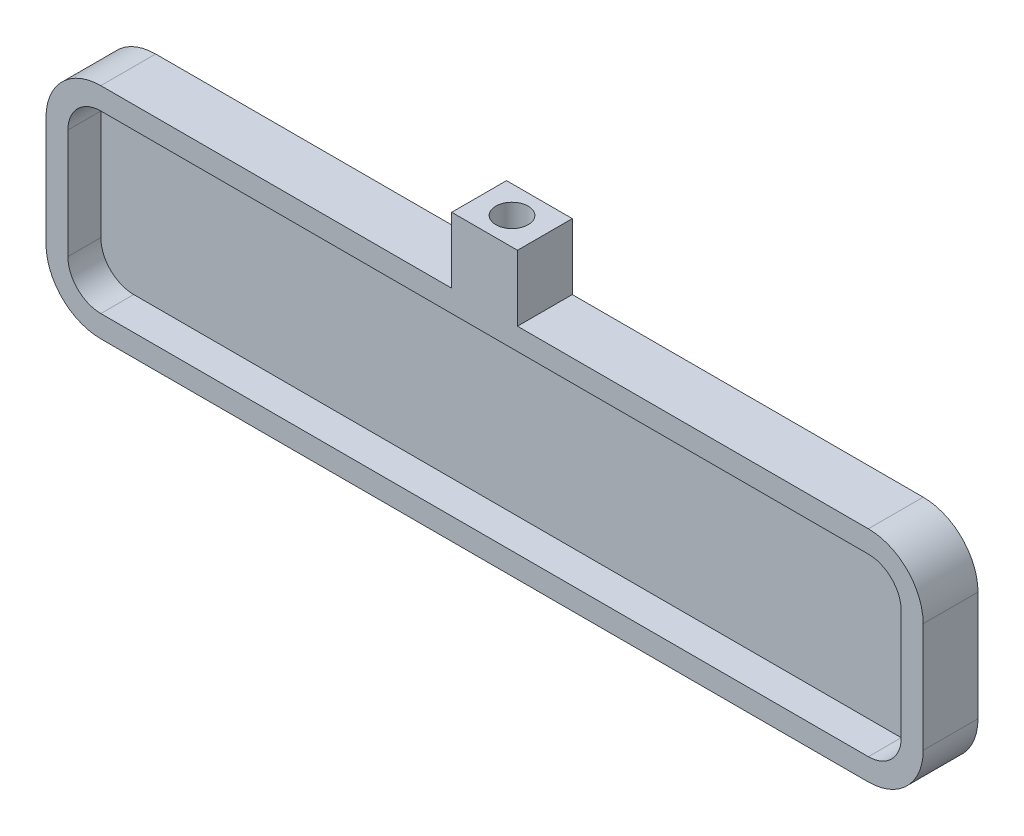
ISO-10303-21;
HEADER;
FILE_DESCRIPTION(('STEP AP214'),'2;1');
FILE_NAME('part.step','',(''),(''),'','','');
FILE_SCHEMA(('AUTOMOTIVE_DESIGN { 1 0 10303 214 1 1 1 1 }'));
ENDSEC;
DATA;
#1=APPLICATION_CONTEXT('core data for automotive mechanical design processes');
#2=APPLICATION_PROTOCOL_DEFINITION('international standard','automotive_design',2000,#1);
#3=PRODUCT_CONTEXT('',#1,'mechanical');
#4=PRODUCT('Part','Part','',(#3));
#5=PRODUCT_RELATED_PRODUCT_CATEGORY('part','',(#4));
#6=PRODUCT_DEFINITION_FORMATION('','',#4);
#7=PRODUCT_DEFINITION_CONTEXT('part definition',#1,'design');
#8=PRODUCT_DEFINITION('design','',#6,#7);
#9=PRODUCT_DEFINITION_SHAPE('','',#8);
#10=(LENGTH_UNIT() NAMED_UNIT(*) SI_UNIT(.MILLI.,.METRE.));
#11=(NAMED_UNIT(*) PLANE_ANGLE_UNIT() SI_UNIT($,.RADIAN.));
#12=(NAMED_UNIT(*) SI_UNIT($,.STERADIAN.) SOLID_ANGLE_UNIT());
#13=UNCERTAINTY_MEASURE_WITH_UNIT(LENGTH_MEASURE(1.E-05),#10,'distance_accuracy_value','');
#14=(GEOMETRIC_REPRESENTATION_CONTEXT(3) GLOBAL_UNCERTAINTY_ASSIGNED_CONTEXT((#13)) GLOBAL_UNIT_ASSIGNED_CONTEXT((#10,
#11,#12)) REPRESENTATION_CONTEXT('',''));
#15=CARTESIAN_POINT('',(0.,0.,0.));
#16=DIRECTION('',(0.,0.,1.));
#17=DIRECTION('',(1.,0.,0.));
#18=AXIS2_PLACEMENT_3D('',#15,#16,#17);
#19=CARTESIAN_POINT('',(-40.,10.,5.));
#20=DIRECTION('',(0.,-1.,0.));
#21=DIRECTION('',(0.,0.,-1.));
#22=AXIS2_PLACEMENT_3D('',#19,#20,#21);
#23=PLANE('',#22);
#24=DIRECTION('',(0.,0.,1.));
#25=VECTOR('',#24,1.);
#26=CARTESIAN_POINT('',(-3.,10.,0.));
#27=LINE('',#26,#25);
#28=CARTESIAN_POINT('',(-3.,10.,0.));
#29=VERTEX_POINT('',#28);
#30=CARTESIAN_POINT('',(-3.,10.,5.));
#31=VERTEX_POINT('',#30);
#32=EDGE_CURVE('E202',#29,#31,#27,.T.);
#33=ORIENTED_EDGE('',*,*,#32,.F.);
#34=DIRECTION('',(-1.,0.,0.));
#35=VECTOR('',#34,1.);
#36=CARTESIAN_POINT('',(-40.,10.,0.));
#37=LINE('',#36,#35);
#38=CARTESIAN_POINT('',(-35.,10.,0.));
#39=VERTEX_POINT('',#38);
#40=EDGE_CURVE('E187',#29,#39,#37,.T.);
#41=ORIENTED_EDGE('',*,*,#40,.T.);
#42=DIRECTION('',(0.,0.,-1.));
#43=VECTOR('',#42,1.);
#44=CARTESIAN_POINT('',(-35.,10.,5.));
#45=LINE('',#44,#43);
#46=CARTESIAN_POINT('',(-35.,10.,5.));
#47=VERTEX_POINT('',#46);
#48=EDGE_CURVE('E308',#39,#47,#45,.F.);
#49=ORIENTED_EDGE('',*,*,#48,.T.);
#50=DIRECTION('',(-1.,0.,0.));
#51=VECTOR('',#50,1.);
#52=CARTESIAN_POINT('',(-40.,10.,5.));
#53=LINE('',#52,#51);
#54=EDGE_CURVE('E47',#31,#47,#53,.T.);
#55=ORIENTED_EDGE('',*,*,#54,.F.);
#56=EDGE_LOOP('',(#33,#41,#49,#55));
#57=FACE_BOUND('',#56,.T.);
#58=ADVANCED_FACE('F32',(#57),#23,.F.);
#59=DIRECTION('',(0.,0.,-1.));
#60=VECTOR('',#59,1.);
#61=CARTESIAN_POINT('',(3.,10.,5.));
#62=LINE('',#61,#60);
#63=CARTESIAN_POINT('',(3.,10.,5.));
#64=VERTEX_POINT('',#63);
#65=CARTESIAN_POINT('',(3.,10.,0.));
#66=VERTEX_POINT('',#65);
#67=EDGE_CURVE('E55',#64,#66,#62,.T.);
#68=ORIENTED_EDGE('',*,*,#67,.F.);
#69=CARTESIAN_POINT('',(35.,10.,5.));
#70=VERTEX_POINT('',#69);
#71=EDGE_CURVE('E275',#70,#64,#53,.T.);
#72=ORIENTED_EDGE('',*,*,#71,.F.);
#73=DIRECTION('',(0.,0.,-1.));
#74=VECTOR('',#73,1.);
#75=CARTESIAN_POINT('',(35.,10.,5.));
#76=LINE('',#75,#74);
#77=CARTESIAN_POINT('',(35.,10.,0.));
#78=VERTEX_POINT('',#77);
#79=EDGE_CURVE('E305',#70,#78,#76,.T.);
#80=ORIENTED_EDGE('',*,*,#79,.T.);
#81=EDGE_CURVE('E286',#78,#66,#37,.T.);
#82=ORIENTED_EDGE('',*,*,#81,.T.);
#83=EDGE_LOOP('',(#68,#72,#80,#82));
#84=FACE_BOUND('',#83,.T.);
#85=ADVANCED_FACE('F335',(#84),#23,.F.);
#86=CARTESIAN_POINT('',(40.,-10.,5.));
#87=DIRECTION('',(-1.,0.,0.));
#88=DIRECTION('',(0.,0.,1.));
#89=AXIS2_PLACEMENT_3D('',#86,#87,#88);
#90=PLANE('',#89);
#91=DIRECTION('',(0.,1.,0.));
#92=VECTOR('',#91,1.);
#93=CARTESIAN_POINT('',(40.,-10.,5.));
#94=LINE('',#93,#92);
#95=CARTESIAN_POINT('',(40.,-5.,5.));
#96=VERTEX_POINT('',#95);
#97=CARTESIAN_POINT('',(40.,5.,5.));
#98=VERTEX_POINT('',#97);
#99=EDGE_CURVE('E271',#96,#98,#94,.T.);
#100=ORIENTED_EDGE('',*,*,#99,.F.);
#101=DIRECTION('',(0.,0.,-1.));
#102=VECTOR('',#101,1.);
#103=CARTESIAN_POINT('',(40.,-5.,5.));
#104=LINE('',#103,#102);
#105=CARTESIAN_POINT('',(40.,-5.,0.));
#106=VERTEX_POINT('',#105);
#107=EDGE_CURVE('E11',#96,#106,#104,.T.);
#108=ORIENTED_EDGE('',*,*,#107,.T.);
#109=DIRECTION('',(0.,1.,0.));
#110=VECTOR('',#109,1.);
#111=CARTESIAN_POINT('',(40.,-10.,0.));
#112=LINE('',#111,#110);
#113=CARTESIAN_POINT('',(40.,5.,0.));
#114=VERTEX_POINT('',#113);
#115=EDGE_CURVE('E214',#106,#114,#112,.T.);
#116=ORIENTED_EDGE('',*,*,#115,.T.);
#117=DIRECTION('',(0.,0.,-1.));
#118=VECTOR('',#117,1.);
#119=CARTESIAN_POINT('',(40.,5.,5.));
#120=LINE('',#119,#118);
#121=EDGE_CURVE('E40',#114,#98,#120,.F.);
#122=ORIENTED_EDGE('',*,*,#121,.T.);
#123=EDGE_LOOP('',(#100,#108,#116,#122));
#124=FACE_BOUND('',#123,.T.);
#125=ADVANCED_FACE('F325',(#124),#90,.F.);
#126=CARTESIAN_POINT('',(-40.,-10.,5.));
#127=DIRECTION('',(1.,0.,0.));
#128=DIRECTION('',(0.,0.,-1.));
#129=AXIS2_PLACEMENT_3D('',#126,#127,#128);
#130=PLANE('',#129);
#131=DIRECTION('',(0.,-1.,0.));
#132=VECTOR('',#131,1.);
#133=CARTESIAN_POINT('',(-40.,-10.,5.));
#134=LINE('',#133,#132);
#135=CARTESIAN_POINT('',(-40.,5.,5.));
#136=VERTEX_POINT('',#135);
#137=CARTESIAN_POINT('',(-40.,-5.,5.));
#138=VERTEX_POINT('',#137);
#139=EDGE_CURVE('E277',#136,#138,#134,.T.);
#140=ORIENTED_EDGE('',*,*,#139,.F.);
#141=DIRECTION('',(0.,0.,-1.));
#142=VECTOR('',#141,1.);
#143=CARTESIAN_POINT('',(-40.,5.,5.));
#144=LINE('',#143,#142);
#145=CARTESIAN_POINT('',(-40.,5.,0.));
#146=VERTEX_POINT('',#145);
#147=EDGE_CURVE('E294',#136,#146,#144,.T.);
#148=ORIENTED_EDGE('',*,*,#147,.T.);
#149=DIRECTION('',(0.,-1.,0.));
#150=VECTOR('',#149,1.);
#151=CARTESIAN_POINT('',(-40.,-10.,0.));
#152=LINE('',#151,#150);
#153=CARTESIAN_POINT('',(-40.,-5.,0.));
#154=VERTEX_POINT('',#153);
#155=EDGE_CURVE('E288',#146,#154,#152,.T.);
#156=ORIENTED_EDGE('',*,*,#155,.T.);
#157=DIRECTION('',(0.,0.,-1.));
#158=VECTOR('',#157,1.);
#159=CARTESIAN_POINT('',(-40.,-5.,5.));
#160=LINE('',#159,#158);
#161=EDGE_CURVE('E283',#154,#138,#160,.F.);
#162=ORIENTED_EDGE('',*,*,#161,.T.);
#163=EDGE_LOOP('',(#140,#148,#156,#162));
#164=FACE_BOUND('',#163,.T.);
#165=ADVANCED_FACE('F346',(#164),#130,.F.);
#166=CARTESIAN_POINT('',(-40.,-10.,5.));
#167=DIRECTION('',(0.,1.,0.));
#168=DIRECTION('',(0.,0.,1.));
#169=AXIS2_PLACEMENT_3D('',#166,#167,#168);
#170=PLANE('',#169);
#171=DIRECTION('',(1.,0.,0.));
#172=VECTOR('',#171,1.);
#173=CARTESIAN_POINT('',(-40.,-10.,5.));
#174=LINE('',#173,#172);
#175=CARTESIAN_POINT('',(-35.,-10.,5.));
#176=VERTEX_POINT('',#175);
#177=CARTESIAN_POINT('',(35.,-10.,5.));
#178=VERTEX_POINT('',#177);
#179=EDGE_CURVE('E280',#176,#178,#174,.T.);
#180=ORIENTED_EDGE('',*,*,#179,.F.);
#181=DIRECTION('',(0.,0.,-1.));
#182=VECTOR('',#181,1.);
#183=CARTESIAN_POINT('',(-35.,-10.,5.));
#184=LINE('',#183,#182);
#185=CARTESIAN_POINT('',(-35.,-10.,0.));
#186=VERTEX_POINT('',#185);
#187=EDGE_CURVE('E320',#176,#186,#184,.T.);
#188=ORIENTED_EDGE('',*,*,#187,.T.);
#189=DIRECTION('',(1.,0.,0.));
#190=VECTOR('',#189,1.);
#191=CARTESIAN_POINT('',(-40.,-10.,0.));
#192=LINE('',#191,#190);
#193=CARTESIAN_POINT('',(35.,-10.,0.));
#194=VERTEX_POINT('',#193);
#195=EDGE_CURVE('E274',#186,#194,#192,.T.);
#196=ORIENTED_EDGE('',*,*,#195,.T.);
#197=DIRECTION('',(0.,0.,-1.));
#198=VECTOR('',#197,1.);
#199=CARTESIAN_POINT('',(35.,-10.,5.));
#200=LINE('',#199,#198);
#201=EDGE_CURVE('E318',#194,#178,#200,.F.);
#202=ORIENTED_EDGE('',*,*,#201,.T.);
#203=EDGE_LOOP('',(#180,#188,#196,#202));
#204=FACE_BOUND('',#203,.T.);
#205=ADVANCED_FACE('F355',(#204),#170,.F.);
#206=CARTESIAN_POINT('',(0.,0.,5.));
#207=DIRECTION('',(0.,0.,-1.));
#208=DIRECTION('',(-1.,0.,0.));
#209=AXIS2_PLACEMENT_3D('',#206,#207,#208);
#210=PLANE('',#209);
#211=DIRECTION('',(-1.,0.,0.));
#212=VECTOR('',#211,1.);
#213=CARTESIAN_POINT('',(0.,8.,5.));
#214=LINE('',#213,#212);
#215=CARTESIAN_POINT('',(35.,8.,5.));
#216=VERTEX_POINT('',#215);
#217=CARTESIAN_POINT('',(-35.,8.,5.));
#218=VERTEX_POINT('',#217);
#219=EDGE_CURVE('E257',#216,#218,#214,.T.);
#220=ORIENTED_EDGE('',*,*,#219,.F.);
#221=CARTESIAN_POINT('',(35.,5.,5.));
#222=DIRECTION('',(0.,0.,-1.));
#223=DIRECTION('',(-1.,0.,0.));
#224=AXIS2_PLACEMENT_3D('',#221,#222,#223);
#225=CIRCLE('',#224,3.);
#226=CARTESIAN_POINT('',(38.,5.,5.));
#227=VERTEX_POINT('',#226);
#228=EDGE_CURVE('E243',#227,#216,#225,.F.);
#229=ORIENTED_EDGE('',*,*,#228,.F.);
#230=DIRECTION('',(0.,1.,0.));
#231=VECTOR('',#230,1.);
#232=CARTESIAN_POINT('',(38.,0.,5.));
#233=LINE('',#232,#231);
#234=CARTESIAN_POINT('',(38.,-5.,5.));
#235=VERTEX_POINT('',#234);
#236=EDGE_CURVE('E239',#235,#227,#233,.T.);
#237=ORIENTED_EDGE('',*,*,#236,.F.);
#238=CARTESIAN_POINT('',(35.,-5.,5.));
#239=DIRECTION('',(0.,0.,-1.));
#240=DIRECTION('',(-1.,0.,0.));
#241=AXIS2_PLACEMENT_3D('',#238,#239,#240);
#242=CIRCLE('',#241,3.);
#243=CARTESIAN_POINT('',(35.,-8.,5.));
#244=VERTEX_POINT('',#243);
#245=EDGE_CURVE('E259',#244,#235,#242,.F.);
#246=ORIENTED_EDGE('',*,*,#245,.F.);
#247=DIRECTION('',(1.,0.,0.));
#248=VECTOR('',#247,1.);
#249=CARTESIAN_POINT('',(0.,-8.,5.));
#250=LINE('',#249,#248);
#251=CARTESIAN_POINT('',(-35.,-8.,5.));
#252=VERTEX_POINT('',#251);
#253=EDGE_CURVE('E250',#252,#244,#250,.T.);
#254=ORIENTED_EDGE('',*,*,#253,.F.);
#255=CARTESIAN_POINT('',(-35.,-5.,5.));
#256=DIRECTION('',(0.,0.,-1.));
#257=DIRECTION('',(-1.,0.,0.));
#258=AXIS2_PLACEMENT_3D('',#255,#256,#257);
#259=CIRCLE('',#258,3.);
#260=CARTESIAN_POINT('',(-38.,-5.,5.));
#261=VERTEX_POINT('',#260);
#262=EDGE_CURVE('E264',#261,#252,#259,.F.);
#263=ORIENTED_EDGE('',*,*,#262,.F.);
#264=DIRECTION('',(0.,-1.,0.));
#265=VECTOR('',#264,1.);
#266=CARTESIAN_POINT('',(-38.,0.,5.));
#267=LINE('',#266,#265);
#268=CARTESIAN_POINT('',(-38.,5.,5.));
#269=VERTEX_POINT('',#268);
#270=EDGE_CURVE('E262',#269,#261,#267,.T.);
#271=ORIENTED_EDGE('',*,*,#270,.F.);
#272=CARTESIAN_POINT('',(-35.,5.,5.));
#273=DIRECTION('',(0.,0.,-1.));
#274=DIRECTION('',(-1.,0.,0.));
#275=AXIS2_PLACEMENT_3D('',#272,#273,#274);
#276=CIRCLE('',#275,3.);
#277=EDGE_CURVE('E255',#218,#269,#276,.F.);
#278=ORIENTED_EDGE('',*,*,#277,.F.);
#279=EDGE_LOOP('',(#220,#229,#237,#246,#254,#263,#271,#278));
#280=FACE_BOUND('',#279,.T.);
#281=ORIENTED_EDGE('',*,*,#71,.T.);
#282=DIRECTION('',(0.,-1.,0.));
#283=VECTOR('',#282,1.);
#284=CARTESIAN_POINT('',(3.,16.,5.));
#285=LINE('',#284,#283);
#286=CARTESIAN_POINT('',(3.,16.,5.));
#287=VERTEX_POINT('',#286);
#288=EDGE_CURVE('E207',#287,#64,#285,.T.);
#289=ORIENTED_EDGE('',*,*,#288,.F.);
#290=DIRECTION('',(1.,0.,0.));
#291=VECTOR('',#290,1.);
#292=CARTESIAN_POINT('',(-3.,16.,5.));
#293=LINE('',#292,#291);
#294=CARTESIAN_POINT('',(-3.,16.,5.));
#295=VERTEX_POINT('',#294);
#296=EDGE_CURVE('E195',#295,#287,#293,.T.);
#297=ORIENTED_EDGE('',*,*,#296,.F.);
#298=DIRECTION('',(0.,-1.,0.));
#299=VECTOR('',#298,1.);
#300=CARTESIAN_POINT('',(-3.,16.,5.));
#301=LINE('',#300,#299);
#302=EDGE_CURVE('E190',#295,#31,#301,.T.);
#303=ORIENTED_EDGE('',*,*,#302,.T.);
#304=ORIENTED_EDGE('',*,*,#54,.T.);
#305=CARTESIAN_POINT('',(-35.,5.,5.));
#306=DIRECTION('',(0.,0.,-1.));
#307=DIRECTION('',(-1.,0.,0.));
#308=AXIS2_PLACEMENT_3D('',#305,#306,#307);
#309=CIRCLE('',#308,5.);
#310=EDGE_CURVE('E316',#47,#136,#309,.F.);
#311=ORIENTED_EDGE('',*,*,#310,.T.);
#312=ORIENTED_EDGE('',*,*,#139,.T.);
#313=CARTESIAN_POINT('',(-35.,-5.,5.));
#314=DIRECTION('',(0.,0.,-1.));
#315=DIRECTION('',(-1.,0.,0.));
#316=AXIS2_PLACEMENT_3D('',#313,#314,#315);
#317=CIRCLE('',#316,5.);
#318=EDGE_CURVE('E314',#138,#176,#317,.F.);
#319=ORIENTED_EDGE('',*,*,#318,.T.);
#320=ORIENTED_EDGE('',*,*,#179,.T.);
#321=CARTESIAN_POINT('',(35.,-5.,5.));
#322=DIRECTION('',(0.,0.,-1.));
#323=DIRECTION('',(-1.,0.,0.));
#324=AXIS2_PLACEMENT_3D('',#321,#322,#323);
#325=CIRCLE('',#324,5.);
#326=EDGE_CURVE('E312',#178,#96,#325,.F.);
#327=ORIENTED_EDGE('',*,*,#326,.T.);
#328=ORIENTED_EDGE('',*,*,#99,.T.);
#329=CARTESIAN_POINT('',(35.,5.,5.));
#330=DIRECTION('',(0.,0.,-1.));
#331=DIRECTION('',(-1.,0.,0.));
#332=AXIS2_PLACEMENT_3D('',#329,#330,#331);
#333=CIRCLE('',#332,5.);
#334=EDGE_CURVE('E310',#98,#70,#333,.F.);
#335=ORIENTED_EDGE('',*,*,#334,.T.);
#336=EDGE_LOOP('',(#281,#289,#297,#303,#304,#311,#312,#319,#320,#327,#328,#335));
#337=FACE_BOUND('',#336,.T.);
#338=ADVANCED_FACE('F331',(#280,#337),#210,.F.);
#339=CARTESIAN_POINT('',(0.,0.,0.));
#340=DIRECTION('',(0.,0.,-1.));
#341=DIRECTION('',(-1.,0.,0.));
#342=AXIS2_PLACEMENT_3D('',#339,#340,#341);
#343=PLANE('',#342);
#344=ORIENTED_EDGE('',*,*,#155,.F.);
#345=CARTESIAN_POINT('',(-35.,5.,0.));
#346=DIRECTION('',(0.,0.,-1.));
#347=DIRECTION('',(-1.,0.,0.));
#348=AXIS2_PLACEMENT_3D('',#345,#346,#347);
#349=CIRCLE('',#348,5.);
#350=EDGE_CURVE('E303',#146,#39,#349,.T.);
#351=ORIENTED_EDGE('',*,*,#350,.T.);
#352=ORIENTED_EDGE('',*,*,#40,.F.);
#353=DIRECTION('',(0.,-1.,0.));
#354=VECTOR('',#353,1.);
#355=CARTESIAN_POINT('',(-3.,16.,0.));
#356=LINE('',#355,#354);
#357=CARTESIAN_POINT('',(-3.,16.,0.));
#358=VERTEX_POINT('',#357);
#359=EDGE_CURVE('E183',#358,#29,#356,.T.);
#360=ORIENTED_EDGE('',*,*,#359,.F.);
#361=DIRECTION('',(-1.,0.,0.));
#362=VECTOR('',#361,1.);
#363=CARTESIAN_POINT('',(3.,16.,0.));
#364=LINE('',#363,#362);
#365=CARTESIAN_POINT('',(3.,16.,0.));
#366=VERTEX_POINT('',#365);
#367=EDGE_CURVE('E170',#366,#358,#364,.T.);
#368=ORIENTED_EDGE('',*,*,#367,.F.);
#369=DIRECTION('',(0.,-1.,0.));
#370=VECTOR('',#369,1.);
#371=CARTESIAN_POINT('',(3.,16.,0.));
#372=LINE('',#371,#370);
#373=EDGE_CURVE('E201',#366,#66,#372,.T.);
#374=ORIENTED_EDGE('',*,*,#373,.T.);
#375=ORIENTED_EDGE('',*,*,#81,.F.);
#376=CARTESIAN_POINT('',(35.,5.,0.));
#377=DIRECTION('',(0.,0.,-1.));
#378=DIRECTION('',(-1.,0.,0.));
#379=AXIS2_PLACEMENT_3D('',#376,#377,#378);
#380=CIRCLE('',#379,5.);
#381=EDGE_CURVE('E297',#78,#114,#380,.T.);
#382=ORIENTED_EDGE('',*,*,#381,.T.);
#383=ORIENTED_EDGE('',*,*,#115,.F.);
#384=CARTESIAN_POINT('',(35.,-5.,0.));
#385=DIRECTION('',(0.,0.,-1.));
#386=DIRECTION('',(-1.,0.,0.));
#387=AXIS2_PLACEMENT_3D('',#384,#385,#386);
#388=CIRCLE('',#387,5.);
#389=EDGE_CURVE('E299',#106,#194,#388,.T.);
#390=ORIENTED_EDGE('',*,*,#389,.T.);
#391=ORIENTED_EDGE('',*,*,#195,.F.);
#392=CARTESIAN_POINT('',(-35.,-5.,0.));
#393=DIRECTION('',(0.,0.,-1.));
#394=DIRECTION('',(-1.,0.,0.));
#395=AXIS2_PLACEMENT_3D('',#392,#393,#394);
#396=CIRCLE('',#395,5.);
#397=EDGE_CURVE('E301',#186,#154,#396,.T.);
#398=ORIENTED_EDGE('',*,*,#397,.T.);
#399=EDGE_LOOP('',(#344,#351,#352,#360,#368,#374,#375,#382,#383,#390,#391,#398));
#400=FACE_BOUND('',#399,.T.);
#401=ADVANCED_FACE('F185',(#400),#343,.T.);
#402=CARTESIAN_POINT('',(-35.,5.,5.));
#403=DIRECTION('',(0.,0.,-1.));
#404=DIRECTION('',(-1.,0.,0.));
#405=AXIS2_PLACEMENT_3D('',#402,#403,#404);
#406=CYLINDRICAL_SURFACE('',#405,5.);
#407=ORIENTED_EDGE('',*,*,#310,.F.);
#408=ORIENTED_EDGE('',*,*,#48,.F.);
#409=ORIENTED_EDGE('',*,*,#350,.F.);
#410=ORIENTED_EDGE('',*,*,#147,.F.);
#411=EDGE_LOOP('',(#407,#408,#409,#410));
#412=FACE_BOUND('',#411,.T.);
#413=ADVANCED_FACE('F344',(#412),#406,.T.);
#414=CARTESIAN_POINT('',(-35.,-5.,5.));
#415=DIRECTION('',(0.,0.,-1.));
#416=DIRECTION('',(-1.,0.,0.));
#417=AXIS2_PLACEMENT_3D('',#414,#415,#416);
#418=CYLINDRICAL_SURFACE('',#417,5.);
#419=ORIENTED_EDGE('',*,*,#318,.F.);
#420=ORIENTED_EDGE('',*,*,#161,.F.);
#421=ORIENTED_EDGE('',*,*,#397,.F.);
#422=ORIENTED_EDGE('',*,*,#187,.F.);
#423=EDGE_LOOP('',(#419,#420,#421,#422));
#424=FACE_BOUND('',#423,.T.);
#425=ADVANCED_FACE('F352',(#424),#418,.T.);
#426=CARTESIAN_POINT('',(35.,-5.,5.));
#427=DIRECTION('',(0.,0.,-1.));
#428=DIRECTION('',(-1.,0.,0.));
#429=AXIS2_PLACEMENT_3D('',#426,#427,#428);
#430=CYLINDRICAL_SURFACE('',#429,5.);
#431=ORIENTED_EDGE('',*,*,#326,.F.);
#432=ORIENTED_EDGE('',*,*,#201,.F.);
#433=ORIENTED_EDGE('',*,*,#389,.F.);
#434=ORIENTED_EDGE('',*,*,#107,.F.);
#435=EDGE_LOOP('',(#431,#432,#433,#434));
#436=FACE_BOUND('',#435,.T.);
#437=ADVANCED_FACE('F358',(#436),#430,.T.);
#438=CARTESIAN_POINT('',(35.,5.,5.));
#439=DIRECTION('',(0.,0.,-1.));
#440=DIRECTION('',(-1.,0.,0.));
#441=AXIS2_PLACEMENT_3D('',#438,#439,#440);
#442=CYLINDRICAL_SURFACE('',#441,5.);
#443=ORIENTED_EDGE('',*,*,#334,.F.);
#444=ORIENTED_EDGE('',*,*,#121,.F.);
#445=ORIENTED_EDGE('',*,*,#381,.F.);
#446=ORIENTED_EDGE('',*,*,#79,.F.);
#447=EDGE_LOOP('',(#443,#444,#445,#446));
#448=FACE_BOUND('',#447,.T.);
#449=ADVANCED_FACE('F34',(#448),#442,.T.);
#450=CARTESIAN_POINT('',(38.,-10.,5.));
#451=DIRECTION('',(-1.,0.,0.));
#452=DIRECTION('',(0.,0.,1.));
#453=AXIS2_PLACEMENT_3D('',#450,#451,#452);
#454=PLANE('',#453);
#455=ORIENTED_EDGE('',*,*,#236,.T.);
#456=DIRECTION('',(0.,0.,1.));
#457=VECTOR('',#456,1.);
#458=CARTESIAN_POINT('',(38.,5.,5.));
#459=LINE('',#458,#457);
#460=CARTESIAN_POINT('',(38.,5.,2.));
#461=VERTEX_POINT('',#460);
#462=EDGE_CURVE('E215',#461,#227,#459,.T.);
#463=ORIENTED_EDGE('',*,*,#462,.F.);
#464=DIRECTION('',(0.,1.,0.));
#465=VECTOR('',#464,1.);
#466=CARTESIAN_POINT('',(38.,0.,2.));
#467=LINE('',#466,#465);
#468=CARTESIAN_POINT('',(38.,-5.,2.));
#469=VERTEX_POINT('',#468);
#470=EDGE_CURVE('E189',#469,#461,#467,.T.);
#471=ORIENTED_EDGE('',*,*,#470,.F.);
#472=DIRECTION('',(0.,0.,1.));
#473=VECTOR('',#472,1.);
#474=CARTESIAN_POINT('',(38.,-5.,5.));
#475=LINE('',#474,#473);
#476=EDGE_CURVE('E211',#235,#469,#475,.F.);
#477=ORIENTED_EDGE('',*,*,#476,.F.);
#478=EDGE_LOOP('',(#455,#463,#471,#477));
#479=FACE_BOUND('',#478,.T.);
#480=ADVANCED_FACE('F364',(#479),#454,.T.);
#481=CARTESIAN_POINT('',(-40.,8.,5.));
#482=DIRECTION('',(0.,-1.,0.));
#483=DIRECTION('',(0.,0.,-1.));
#484=AXIS2_PLACEMENT_3D('',#481,#482,#483);
#485=PLANE('',#484);
#486=DIRECTION('',(-1.,0.,0.));
#487=VECTOR('',#486,1.);
#488=CARTESIAN_POINT('',(0.,8.,2.));
#489=LINE('',#488,#487);
#490=CARTESIAN_POINT('',(35.,8.,2.));
#491=VERTEX_POINT('',#490);
#492=CARTESIAN_POINT('',(-35.,8.,2.));
#493=VERTEX_POINT('',#492);
#494=EDGE_CURVE('E218',#491,#493,#489,.T.);
#495=ORIENTED_EDGE('',*,*,#494,.F.);
#496=DIRECTION('',(0.,0.,-1.));
#497=VECTOR('',#496,1.);
#498=CARTESIAN_POINT('',(35.,8.,5.));
#499=LINE('',#498,#497);
#500=EDGE_CURVE('E228',#216,#491,#499,.T.);
#501=ORIENTED_EDGE('',*,*,#500,.F.);
#502=ORIENTED_EDGE('',*,*,#219,.T.);
#503=DIRECTION('',(0.,0.,-1.));
#504=VECTOR('',#503,1.);
#505=CARTESIAN_POINT('',(-35.,8.,5.));
#506=LINE('',#505,#504);
#507=EDGE_CURVE('E241',#493,#218,#506,.F.);
#508=ORIENTED_EDGE('',*,*,#507,.F.);
#509=EDGE_LOOP('',(#495,#501,#502,#508));
#510=FACE_BOUND('',#509,.T.);
#511=ADVANCED_FACE('F472',(#510),#485,.T.);
#512=CARTESIAN_POINT('',(-38.,-10.,5.));
#513=DIRECTION('',(1.,0.,0.));
#514=DIRECTION('',(0.,0.,-1.));
#515=AXIS2_PLACEMENT_3D('',#512,#513,#514);
#516=PLANE('',#515);
#517=ORIENTED_EDGE('',*,*,#270,.T.);
#518=DIRECTION('',(0.,0.,-1.));
#519=VECTOR('',#518,1.);
#520=CARTESIAN_POINT('',(-38.,-5.,5.));
#521=LINE('',#520,#519);
#522=CARTESIAN_POINT('',(-38.,-5.,2.));
#523=VERTEX_POINT('',#522);
#524=EDGE_CURVE('E248',#523,#261,#521,.F.);
#525=ORIENTED_EDGE('',*,*,#524,.F.);
#526=DIRECTION('',(0.,-1.,0.));
#527=VECTOR('',#526,1.);
#528=CARTESIAN_POINT('',(-38.,0.,2.));
#529=LINE('',#528,#527);
#530=CARTESIAN_POINT('',(-38.,5.,2.));
#531=VERTEX_POINT('',#530);
#532=EDGE_CURVE('E222',#531,#523,#529,.T.);
#533=ORIENTED_EDGE('',*,*,#532,.F.);
#534=DIRECTION('',(0.,0.,-1.));
#535=VECTOR('',#534,1.);
#536=CARTESIAN_POINT('',(-38.,5.,5.));
#537=LINE('',#536,#535);
#538=EDGE_CURVE('E235',#269,#531,#537,.T.);
#539=ORIENTED_EDGE('',*,*,#538,.F.);
#540=EDGE_LOOP('',(#517,#525,#533,#539));
#541=FACE_BOUND('',#540,.T.);
#542=ADVANCED_FACE('F476',(#541),#516,.T.);
#543=CARTESIAN_POINT('',(-40.,-8.,5.));
#544=DIRECTION('',(0.,1.,0.));
#545=DIRECTION('',(0.,0.,1.));
#546=AXIS2_PLACEMENT_3D('',#543,#544,#545);
#547=PLANE('',#546);
#548=ORIENTED_EDGE('',*,*,#253,.T.);
#549=DIRECTION('',(0.,0.,1.));
#550=VECTOR('',#549,1.);
#551=CARTESIAN_POINT('',(35.,-8.,5.));
#552=LINE('',#551,#550);
#553=CARTESIAN_POINT('',(35.,-8.,2.));
#554=VERTEX_POINT('',#553);
#555=EDGE_CURVE('E253',#554,#244,#552,.T.);
#556=ORIENTED_EDGE('',*,*,#555,.F.);
#557=DIRECTION('',(1.,0.,0.));
#558=VECTOR('',#557,1.);
#559=CARTESIAN_POINT('',(0.,-8.,2.));
#560=LINE('',#559,#558);
#561=CARTESIAN_POINT('',(-35.,-8.,2.));
#562=VERTEX_POINT('',#561);
#563=EDGE_CURVE('E225',#562,#554,#560,.T.);
#564=ORIENTED_EDGE('',*,*,#563,.F.);
#565=DIRECTION('',(0.,0.,1.));
#566=VECTOR('',#565,1.);
#567=CARTESIAN_POINT('',(-35.,-8.,5.));
#568=LINE('',#567,#566);
#569=EDGE_CURVE('E221',#252,#562,#568,.F.);
#570=ORIENTED_EDGE('',*,*,#569,.F.);
#571=EDGE_LOOP('',(#548,#556,#564,#570));
#572=FACE_BOUND('',#571,.T.);
#573=ADVANCED_FACE('F480',(#572),#547,.T.);
#574=CARTESIAN_POINT('',(0.,0.,2.));
#575=DIRECTION('',(0.,0.,-1.));
#576=DIRECTION('',(-1.,0.,0.));
#577=AXIS2_PLACEMENT_3D('',#574,#575,#576);
#578=PLANE('',#577);
#579=ORIENTED_EDGE('',*,*,#532,.T.);
#580=CARTESIAN_POINT('',(-35.,-5.,2.));
#581=DIRECTION('',(0.,0.,-1.));
#582=DIRECTION('',(-1.,0.,0.));
#583=AXIS2_PLACEMENT_3D('',#580,#581,#582);
#584=CIRCLE('',#583,3.);
#585=EDGE_CURVE('E229',#562,#523,#584,.T.);
#586=ORIENTED_EDGE('',*,*,#585,.F.);
#587=ORIENTED_EDGE('',*,*,#563,.T.);
#588=CARTESIAN_POINT('',(35.,-5.,2.));
#589=DIRECTION('',(0.,0.,-1.));
#590=DIRECTION('',(-1.,0.,0.));
#591=AXIS2_PLACEMENT_3D('',#588,#589,#590);
#592=CIRCLE('',#591,3.);
#593=EDGE_CURVE('E234',#469,#554,#592,.T.);
#594=ORIENTED_EDGE('',*,*,#593,.F.);
#595=ORIENTED_EDGE('',*,*,#470,.T.);
#596=CARTESIAN_POINT('',(35.,5.,2.));
#597=DIRECTION('',(0.,0.,-1.));
#598=DIRECTION('',(-1.,0.,0.));
#599=AXIS2_PLACEMENT_3D('',#596,#597,#598);
#600=CIRCLE('',#599,3.);
#601=EDGE_CURVE('E232',#491,#461,#600,.T.);
#602=ORIENTED_EDGE('',*,*,#601,.F.);
#603=ORIENTED_EDGE('',*,*,#494,.T.);
#604=CARTESIAN_POINT('',(-35.,5.,2.));
#605=DIRECTION('',(0.,0.,-1.));
#606=DIRECTION('',(-1.,0.,0.));
#607=AXIS2_PLACEMENT_3D('',#604,#605,#606);
#608=CIRCLE('',#607,3.);
#609=EDGE_CURVE('E226',#531,#493,#608,.T.);
#610=ORIENTED_EDGE('',*,*,#609,.F.);
#611=EDGE_LOOP('',(#579,#586,#587,#594,#595,#602,#603,#610));
#612=FACE_BOUND('',#611,.T.);
#613=ADVANCED_FACE('F484',(#612),#578,.F.);
#614=CARTESIAN_POINT('',(-35.,5.,5.));
#615=DIRECTION('',(0.,0.,-1.));
#616=DIRECTION('',(-1.,0.,0.));
#617=AXIS2_PLACEMENT_3D('',#614,#615,#616);
#618=CYLINDRICAL_SURFACE('',#617,3.);
#619=ORIENTED_EDGE('',*,*,#277,.T.);
#620=ORIENTED_EDGE('',*,*,#538,.T.);
#621=ORIENTED_EDGE('',*,*,#609,.T.);
#622=ORIENTED_EDGE('',*,*,#507,.T.);
#623=EDGE_LOOP('',(#619,#620,#621,#622));
#624=FACE_BOUND('',#623,.T.);
#625=ADVANCED_FACE('F488',(#624),#618,.F.);
#626=CARTESIAN_POINT('',(-35.,-5.,5.));
#627=DIRECTION('',(0.,0.,-1.));
#628=DIRECTION('',(-1.,0.,0.));
#629=AXIS2_PLACEMENT_3D('',#626,#627,#628);
#630=CYLINDRICAL_SURFACE('',#629,3.);
#631=ORIENTED_EDGE('',*,*,#262,.T.);
#632=ORIENTED_EDGE('',*,*,#569,.T.);
#633=ORIENTED_EDGE('',*,*,#585,.T.);
#634=ORIENTED_EDGE('',*,*,#524,.T.);
#635=EDGE_LOOP('',(#631,#632,#633,#634));
#636=FACE_BOUND('',#635,.T.);
#637=ADVANCED_FACE('F492',(#636),#630,.F.);
#638=CARTESIAN_POINT('',(35.,-5.,5.));
#639=DIRECTION('',(0.,0.,-1.));
#640=DIRECTION('',(-1.,0.,0.));
#641=AXIS2_PLACEMENT_3D('',#638,#639,#640);
#642=CYLINDRICAL_SURFACE('',#641,3.);
#643=ORIENTED_EDGE('',*,*,#245,.T.);
#644=ORIENTED_EDGE('',*,*,#476,.T.);
#645=ORIENTED_EDGE('',*,*,#593,.T.);
#646=ORIENTED_EDGE('',*,*,#555,.T.);
#647=EDGE_LOOP('',(#643,#644,#645,#646));
#648=FACE_BOUND('',#647,.T.);
#649=ADVANCED_FACE('F496',(#648),#642,.F.);
#650=CARTESIAN_POINT('',(35.,5.,5.));
#651=DIRECTION('',(0.,0.,-1.));
#652=DIRECTION('',(-1.,0.,0.));
#653=AXIS2_PLACEMENT_3D('',#650,#651,#652);
#654=CYLINDRICAL_SURFACE('',#653,3.);
#655=ORIENTED_EDGE('',*,*,#228,.T.);
#656=ORIENTED_EDGE('',*,*,#500,.T.);
#657=ORIENTED_EDGE('',*,*,#601,.T.);
#658=ORIENTED_EDGE('',*,*,#462,.T.);
#659=EDGE_LOOP('',(#655,#656,#657,#658));
#660=FACE_BOUND('',#659,.T.);
#661=ADVANCED_FACE('F426',(#660),#654,.F.);
#662=CARTESIAN_POINT('',(-3.,16.,0.));
#663=DIRECTION('',(1.,0.,0.));
#664=DIRECTION('',(0.,0.,-1.));
#665=AXIS2_PLACEMENT_3D('',#662,#663,#664);
#666=PLANE('',#665);
#667=ORIENTED_EDGE('',*,*,#32,.T.);
#668=ORIENTED_EDGE('',*,*,#302,.F.);
#669=DIRECTION('',(0.,0.,1.));
#670=VECTOR('',#669,1.);
#671=CARTESIAN_POINT('',(-3.,16.,0.));
#672=LINE('',#671,#670);
#673=EDGE_CURVE('E174',#358,#295,#672,.T.);
#674=ORIENTED_EDGE('',*,*,#673,.F.);
#675=ORIENTED_EDGE('',*,*,#359,.T.);
#676=EDGE_LOOP('',(#667,#668,#674,#675));
#677=FACE_BOUND('',#676,.T.);
#678=ADVANCED_FACE('F192',(#677),#666,.F.);
#679=CARTESIAN_POINT('',(3.,16.,5.));
#680=DIRECTION('',(-1.,0.,0.));
#681=DIRECTION('',(0.,0.,1.));
#682=AXIS2_PLACEMENT_3D('',#679,#680,#681);
#683=PLANE('',#682);
#684=ORIENTED_EDGE('',*,*,#67,.T.);
#685=ORIENTED_EDGE('',*,*,#373,.F.);
#686=DIRECTION('',(0.,0.,-1.));
#687=VECTOR('',#686,1.);
#688=CARTESIAN_POINT('',(3.,16.,5.));
#689=LINE('',#688,#687);
#690=EDGE_CURVE('E177',#287,#366,#689,.T.);
#691=ORIENTED_EDGE('',*,*,#690,.F.);
#692=ORIENTED_EDGE('',*,*,#288,.T.);
#693=EDGE_LOOP('',(#684,#685,#691,#692));
#694=FACE_BOUND('',#693,.T.);
#695=ADVANCED_FACE('F337',(#694),#683,.F.);
#696=CARTESIAN_POINT('',(0.,16.,0.));
#697=DIRECTION('',(0.,1.,0.));
#698=DIRECTION('',(0.,0.,1.));
#699=AXIS2_PLACEMENT_3D('',#696,#697,#698);
#700=PLANE('',#699);
#701=CARTESIAN_POINT('',(0.,16.,2.5));
#702=DIRECTION('',(0.,1.,0.));
#703=DIRECTION('',(0.,0.,1.));
#704=AXIS2_PLACEMENT_3D('',#701,#702,#703);
#705=CIRCLE('',#704,1.475);
#706=CARTESIAN_POINT('',(0.,16.,3.975));
#707=VERTEX_POINT('',#706);
#708=EDGE_CURVE('E609',#707,#707,#705,.T.);
#709=ORIENTED_EDGE('',*,*,#708,.F.);
#710=EDGE_LOOP('',(#709));
#711=FACE_BOUND('',#710,.T.);
#712=ORIENTED_EDGE('',*,*,#367,.T.);
#713=ORIENTED_EDGE('',*,*,#673,.T.);
#714=ORIENTED_EDGE('',*,*,#296,.T.);
#715=ORIENTED_EDGE('',*,*,#690,.T.);
#716=EDGE_LOOP('',(#712,#713,#714,#715));
#717=FACE_BOUND('',#716,.T.);
#718=ADVANCED_FACE('F172',(#711,#717),#700,.T.);
#719=CARTESIAN_POINT('',(0.,12.,2.5));
#720=DIRECTION('',(0.,1.,0.));
#721=DIRECTION('',(0.,0.,1.));
#722=AXIS2_PLACEMENT_3D('',#719,#720,#721);
#723=CYLINDRICAL_SURFACE('',#722,1.475);
#724=CARTESIAN_POINT('',(0.,12.,2.5));
#725=DIRECTION('',(0.,1.,0.));
#726=DIRECTION('',(0.,0.,1.));
#727=AXIS2_PLACEMENT_3D('',#724,#725,#726);
#728=CIRCLE('',#727,1.475);
#729=CARTESIAN_POINT('',(0.,12.,3.975));
#730=VERTEX_POINT('',#729);
#731=EDGE_CURVE('E204',#730,#730,#728,.T.);
#732=ORIENTED_EDGE('',*,*,#731,.F.);
#733=EDGE_LOOP('',(#732));
#734=FACE_BOUND('',#733,.T.);
#735=ORIENTED_EDGE('',*,*,#708,.T.);
#736=EDGE_LOOP('',(#735));
#737=FACE_BOUND('',#736,.T.);
#738=ADVANCED_FACE('F444',(#734,#737),#723,.F.);
#739=CARTESIAN_POINT('',(0.,12.,2.5));
#740=DIRECTION('',(0.,1.,0.));
#741=DIRECTION('',(0.,0.,1.));
#742=AXIS2_PLACEMENT_3D('',#739,#740,#741);
#743=PLANE('',#742);
#744=ORIENTED_EDGE('',*,*,#731,.T.);
#745=EDGE_LOOP('',(#744));
#746=FACE_BOUND('',#745,.T.);
#747=ADVANCED_FACE('F454',(#746),#743,.T.);
#748=CLOSED_SHELL('',(#58,#85,#125,#165,#205,#338,#401,#413,#425,#437,#449,#480,#511,#542,#573,
#613,#625,#637,#649,#661,#678,#695,#718,#738,#747));
#749=MANIFOLD_SOLID_BREP('B2',#748);
#750=ADVANCED_BREP_SHAPE_REPRESENTATION('',(#18,#749),#14);
#751=SHAPE_DEFINITION_REPRESENTATION(#9,#750);
ENDSEC;
END-ISO-10303-21;
